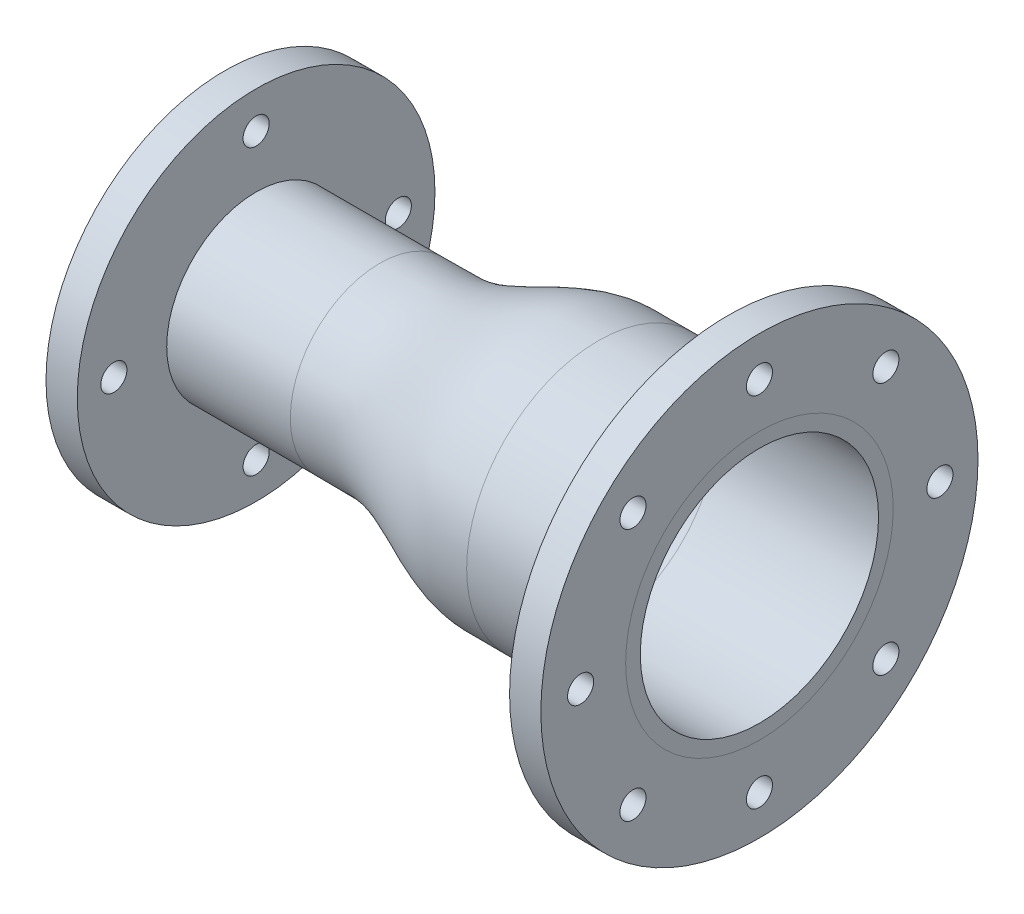
ISO-10303-21;
HEADER;
FILE_DESCRIPTION(('STEP AP214'),'2;1');
FILE_NAME('part.step','',(''),(''),'','','');
FILE_SCHEMA(('AUTOMOTIVE_DESIGN { 1 0 10303 214 1 1 1 1 }'));
ENDSEC;
DATA;
#1=APPLICATION_CONTEXT('core data for automotive mechanical design processes');
#2=APPLICATION_PROTOCOL_DEFINITION('international standard','automotive_design',2000,#1);
#3=PRODUCT_CONTEXT('',#1,'mechanical');
#4=PRODUCT('Part','Part','',(#3));
#5=PRODUCT_RELATED_PRODUCT_CATEGORY('part','',(#4));
#6=PRODUCT_DEFINITION_FORMATION('','',#4);
#7=PRODUCT_DEFINITION_CONTEXT('part definition',#1,'design');
#8=PRODUCT_DEFINITION('design','',#6,#7);
#9=PRODUCT_DEFINITION_SHAPE('','',#8);
#10=(LENGTH_UNIT() NAMED_UNIT(*) SI_UNIT(.MILLI.,.METRE.));
#11=(NAMED_UNIT(*) PLANE_ANGLE_UNIT() SI_UNIT($,.RADIAN.));
#12=(NAMED_UNIT(*) SI_UNIT($,.STERADIAN.) SOLID_ANGLE_UNIT());
#13=UNCERTAINTY_MEASURE_WITH_UNIT(LENGTH_MEASURE(1.E-05),#10,'distance_accuracy_value','');
#14=(GEOMETRIC_REPRESENTATION_CONTEXT(3) GLOBAL_UNCERTAINTY_ASSIGNED_CONTEXT((#13)) GLOBAL_UNIT_ASSIGNED_CONTEXT((#10,
#11,#12)) REPRESENTATION_CONTEXT('',''));
#15=CARTESIAN_POINT('',(0.,0.,0.));
#16=DIRECTION('',(0.,0.,1.));
#17=DIRECTION('',(1.,0.,0.));
#18=AXIS2_PLACEMENT_3D('',#15,#16,#17);
#19=CARTESIAN_POINT('',(341.700000000001,76.1374992115442,0.));
#20=DIRECTION('',(1.,0.,0.));
#21=DIRECTION('',(0.,0.,-1.));
#22=AXIS2_PLACEMENT_3D('',#19,#20,#21);
#23=PLANE('',#22);
#24=CARTESIAN_POINT('',(341.700000000001,114.3,0.));
#25=DIRECTION('',(-1.,0.,0.));
#26=DIRECTION('',(0.,0.,1.));
#27=AXIS2_PLACEMENT_3D('',#24,#25,#26);
#28=CIRCLE('',#27,8.33373999999994);
#29=CARTESIAN_POINT('',(341.700000000001,114.3,8.33373999999994));
#30=VERTEX_POINT('',#29);
#31=EDGE_CURVE('E136',#30,#30,#28,.T.);
#32=ORIENTED_EDGE('',*,*,#31,.T.);
#33=EDGE_LOOP('',(#32));
#34=FACE_BOUND('',#33,.T.);
#35=CARTESIAN_POINT('',(341.700000000001,0.,-115.366574490714));
#36=DIRECTION('',(-1.,0.,0.));
#37=DIRECTION('',(0.,0.,1.));
#38=AXIS2_PLACEMENT_3D('',#35,#36,#37);
#39=CIRCLE('',#38,8.33373999999994);
#40=CARTESIAN_POINT('',(341.700000000001,0.,-107.032834490714));
#41=VERTEX_POINT('',#40);
#42=EDGE_CURVE('E140',#41,#41,#39,.T.);
#43=ORIENTED_EDGE('',*,*,#42,.T.);
#44=EDGE_LOOP('',(#43));
#45=FACE_BOUND('',#44,.T.);
#46=CARTESIAN_POINT('',(341.700000000001,80.822305089622,-80.8223050896228));
#47=DIRECTION('',(-1.,0.,0.));
#48=DIRECTION('',(0.,0.,1.));
#49=AXIS2_PLACEMENT_3D('',#46,#47,#48);
#50=CIRCLE('',#49,8.33373999999994);
#51=CARTESIAN_POINT('',(341.700000000001,80.822305089622,-72.4885650896229));
#52=VERTEX_POINT('',#51);
#53=EDGE_CURVE('E144',#52,#52,#50,.T.);
#54=ORIENTED_EDGE('',*,*,#53,.T.);
#55=EDGE_LOOP('',(#54));
#56=FACE_BOUND('',#55,.T.);
#57=CARTESIAN_POINT('',(341.700000000001,80.8223050896225,80.8223050896222));
#58=DIRECTION('',(-1.,0.,0.));
#59=DIRECTION('',(0.,0.,1.));
#60=AXIS2_PLACEMENT_3D('',#57,#58,#59);
#61=CIRCLE('',#60,8.33373999999994);
#62=CARTESIAN_POINT('',(341.700000000001,80.8223050896225,89.1560450896222));
#63=VERTEX_POINT('',#62);
#64=EDGE_CURVE('E148',#63,#63,#61,.T.);
#65=ORIENTED_EDGE('',*,*,#64,.T.);
#66=EDGE_LOOP('',(#65));
#67=FACE_BOUND('',#66,.T.);
#68=CARTESIAN_POINT('',(341.700000000001,0.,114.3));
#69=DIRECTION('',(-1.,0.,0.));
#70=DIRECTION('',(0.,0.,1.));
#71=AXIS2_PLACEMENT_3D('',#68,#69,#70);
#72=CIRCLE('',#71,8.33373999999994);
#73=CARTESIAN_POINT('',(341.700000000001,0.,122.63374));
#74=VERTEX_POINT('',#73);
#75=EDGE_CURVE('E152',#74,#74,#72,.T.);
#76=ORIENTED_EDGE('',*,*,#75,.T.);
#77=EDGE_LOOP('',(#76));
#78=FACE_BOUND('',#77,.T.);
#79=CARTESIAN_POINT('',(341.700000000001,-80.8223050896222,80.8223050896226));
#80=DIRECTION('',(-1.,0.,0.));
#81=DIRECTION('',(0.,0.,1.));
#82=AXIS2_PLACEMENT_3D('',#79,#80,#81);
#83=CIRCLE('',#82,8.33373999999994);
#84=CARTESIAN_POINT('',(341.700000000001,-80.8223050896222,89.1560450896225));
#85=VERTEX_POINT('',#84);
#86=EDGE_CURVE('E156',#85,#85,#83,.T.);
#87=ORIENTED_EDGE('',*,*,#86,.T.);
#88=EDGE_LOOP('',(#87));
#89=FACE_BOUND('',#88,.T.);
#90=CARTESIAN_POINT('',(341.700000000001,-114.351753494402,0.));
#91=DIRECTION('',(-1.,0.,0.));
#92=DIRECTION('',(0.,0.,1.));
#93=AXIS2_PLACEMENT_3D('',#90,#91,#92);
#94=CIRCLE('',#93,8.33373999999994);
#95=CARTESIAN_POINT('',(341.700000000001,-114.351753494402,8.33373999999994));
#96=VERTEX_POINT('',#95);
#97=EDGE_CURVE('E160',#96,#96,#94,.T.);
#98=ORIENTED_EDGE('',*,*,#97,.T.);
#99=EDGE_LOOP('',(#98));
#100=FACE_BOUND('',#99,.T.);
#101=CARTESIAN_POINT('',(341.700000000001,-80.8223050896231,-80.8223050896217));
#102=DIRECTION('',(-1.,0.,0.));
#103=DIRECTION('',(0.,0.,1.));
#104=AXIS2_PLACEMENT_3D('',#101,#102,#103);
#105=CIRCLE('',#104,8.33373999999994);
#106=CARTESIAN_POINT('',(341.700000000001,-80.8223050896231,-72.4885650896217));
#107=VERTEX_POINT('',#106);
#108=EDGE_CURVE('E164',#107,#107,#105,.T.);
#109=ORIENTED_EDGE('',*,*,#108,.T.);
#110=EDGE_LOOP('',(#109));
#111=FACE_BOUND('',#110,.T.);
#112=CARTESIAN_POINT('',(341.700000000001,0.,0.));
#113=DIRECTION('',(1.,0.,0.));
#114=DIRECTION('',(0.,0.,-1.));
#115=AXIS2_PLACEMENT_3D('',#112,#113,#114);
#116=CIRCLE('',#115,139.7);
#117=CARTESIAN_POINT('',(341.700000000001,0.,-139.7));
#118=VERTEX_POINT('',#117);
#119=EDGE_CURVE('E56',#118,#118,#116,.T.);
#120=ORIENTED_EDGE('',*,*,#119,.T.);
#121=EDGE_LOOP('',(#120));
#122=FACE_BOUND('',#121,.T.);
#123=CARTESIAN_POINT('',(341.700000000001,0.,0.));
#124=DIRECTION('',(1.,0.,0.));
#125=DIRECTION('',(0.,0.,-1.));
#126=AXIS2_PLACEMENT_3D('',#123,#124,#125);
#127=CIRCLE('',#126,85.5);
#128=CARTESIAN_POINT('',(341.700000000001,0.,-85.5));
#129=VERTEX_POINT('',#128);
#130=EDGE_CURVE('E10',#129,#129,#127,.F.);
#131=ORIENTED_EDGE('',*,*,#130,.T.);
#132=EDGE_LOOP('',(#131));
#133=FACE_BOUND('',#132,.T.);
#134=ADVANCED_FACE('F37',(#34,#45,#56,#67,#78,#89,#100,#111,#122,#133),#23,.T.);
#135=CARTESIAN_POINT('',(98.9999999993154,49.1499994635115,0.));
#136=CARTESIAN_POINT('',(102.005905795316,49.1499994635115,0.));
#137=CARTESIAN_POINT('',(106.514717733581,49.1500058205691,0.));
#138=CARTESIAN_POINT('',(111.775161973298,49.1499909865593,0.));
#139=CARTESIAN_POINT('',(114.780889972295,49.1500134485051,0.));
#140=CARTESIAN_POINT('',(117.035873073658,49.1499522232787,0.));
#141=CARTESIAN_POINT('',(118.913072260754,49.1501175034362,0.));
#142=CARTESIAN_POINT('',(120.417271000994,49.1497546651663,0.));
#143=CARTESIAN_POINT('',(121.356980871118,49.1503997728442,0.));
#144=CARTESIAN_POINT('',(122.100741829042,49.1494261179276,0.));
#145=CARTESIAN_POINT('',(122.930150125829,49.1514009467106,0.));
#146=CARTESIAN_POINT('',(124.437765649482,49.1745599052383,0.));
#147=CARTESIAN_POINT('',(127.403841780676,49.3092880479699,0.));
#148=CARTESIAN_POINT('',(131.615917340567,49.7302277733076,0.));
#149=CARTESIAN_POINT('',(136.556364248026,50.5597942292282,0.));
#150=CARTESIAN_POINT('',(141.378908995782,51.6620611481624,0.));
#151=CARTESIAN_POINT('',(147.641323860487,53.4297377742553,0.));
#152=CARTESIAN_POINT('',(155.164556547672,56.0793335742276,0.));
#153=CARTESIAN_POINT('',(163.790302615286,59.6453273603352,0.));
#154=CARTESIAN_POINT('',(172.126179656528,63.3455105597902,0.));
#155=CARTESIAN_POINT('',(180.275439822738,66.9614310497359,0.));
#156=CARTESIAN_POINT('',(188.321466772932,70.2832946888392,0.));
#157=CARTESIAN_POINT('',(194.985358163584,72.6231096372374,0.));
#158=CARTESIAN_POINT('',(200.298712295905,74.1206931091162,0.));
#159=CARTESIAN_POINT('',(204.27061261078,75.0271646674049,0.));
#160=CARTESIAN_POINT('',(208.229301379162,75.6893673997792,0.));
#161=CARTESIAN_POINT('',(211.496695075637,76.0156520568596,0.));
#162=CARTESIAN_POINT('',(213.792519106971,76.1189386638725,0.));
#163=CARTESIAN_POINT('',(215.066881493287,76.1388526472972,0.));
#164=CARTESIAN_POINT('',(216.128457097101,76.1382361001372,0.));
#165=CARTESIAN_POINT('',(217.290602157146,76.1367778298357,0.));
#166=CARTESIAN_POINT('',(218.784669959143,76.1380232475798,0.));
#167=CARTESIAN_POINT('',(220.664664611946,76.1372831486288,0.));
#168=CARTESIAN_POINT('',(222.918904327775,76.1375683266448,0.));
#169=CARTESIAN_POINT('',(225.924981159851,76.1374582812377,0.));
#170=CARTESIAN_POINT('',(231.185175341817,76.1375299775448,0.));
#171=CARTESIAN_POINT('',(235.6940942797,76.1374992113344,0.));
#172=CARTESIAN_POINT('',(238.700000001038,76.1374992115442,0.));
#173=B_SPLINE_CURVE_WITH_KNOTS('',3,(#135,#136,#137,#138,#139,#140,#141,#142,#143,#144,#145,
#146,#147,#148,#149,#150,#151,#152,#153,#154,#155,#156,#157,#158,#159,#160,#161,#162,#163,#164,
#165,#166,#167,#168,#169,#170,#171,#172),.UNSPECIFIED.,.F.,.F.,(4,1,1,1,1,1,1,1,1,1,1,1,1,1,1,1,
1,1,1,1,1,1,1,1,1,1,1,1,1,1,1,1,1,1,1,4),(0.,0.0625,0.09375,0.109375,0.125,0.140625,0.1484375,
0.15625,0.16015625,0.1640625,0.171875,0.1875,0.21875,0.25,0.28125,0.3125,0.375,0.4375,0.5,
0.5625,0.625,0.6875,0.71875,0.75,0.78125,0.8125,0.828125,0.8359375,0.84375,0.8515625,0.859375,
0.875,0.890625,0.90625,0.9375,1.),.UNSPECIFIED.);
#174=CARTESIAN_POINT('',(341.700000000001,0.,0.));
#175=DIRECTION('',(1.,0.,0.));
#176=AXIS1_PLACEMENT('',#174,#175);
#177=SURFACE_OF_REVOLUTION('',#173,#176);
#178=CARTESIAN_POINT('',(238.700000001038,0.,0.));
#179=DIRECTION('',(1.,0.,0.));
#180=DIRECTION('',(0.,0.,-1.));
#181=AXIS2_PLACEMENT_3D('',#178,#179,#180);
#182=CIRCLE('',#181,76.1374992115442);
#183=CARTESIAN_POINT('',(238.700000001038,0.,-76.1374992115442));
#184=VERTEX_POINT('',#183);
#185=EDGE_CURVE('E46',#184,#184,#182,.T.);
#186=ORIENTED_EDGE('',*,*,#185,.T.);
#187=EDGE_LOOP('',(#186));
#188=FACE_BOUND('',#187,.T.);
#189=CARTESIAN_POINT('',(98.9999999993154,0.,0.));
#190=DIRECTION('',(1.,0.,0.));
#191=DIRECTION('',(0.,0.,-1.));
#192=AXIS2_PLACEMENT_3D('',#189,#190,#191);
#193=CIRCLE('',#192,49.1499994635115);
#194=CARTESIAN_POINT('',(98.9999999993154,0.,-49.1499994635115));
#195=VERTEX_POINT('',#194);
#196=EDGE_CURVE('E85',#195,#195,#193,.T.);
#197=ORIENTED_EDGE('',*,*,#196,.F.);
#198=EDGE_LOOP('',(#197));
#199=FACE_BOUND('',#198,.T.);
#200=ADVANCED_FACE('F39',(#188,#199),#177,.F.);
#201=CARTESIAN_POINT('',(341.700000000001,0.,0.));
#202=DIRECTION('',(1.,0.,0.));
#203=DIRECTION('',(0.,0.,-1.));
#204=AXIS2_PLACEMENT_3D('',#201,#202,#203);
#205=CYLINDRICAL_SURFACE('',#204,76.1374992115442);
#206=CARTESIAN_POINT('',(341.700000000001,0.,0.));
#207=DIRECTION('',(1.,0.,0.));
#208=DIRECTION('',(0.,0.,-1.));
#209=AXIS2_PLACEMENT_3D('',#206,#207,#208);
#210=CIRCLE('',#209,76.1374992115442);
#211=CARTESIAN_POINT('',(341.700000000001,0.,-76.1374992115442));
#212=VERTEX_POINT('',#211);
#213=EDGE_CURVE('E52',#212,#212,#210,.T.);
#214=ORIENTED_EDGE('',*,*,#213,.T.);
#215=EDGE_LOOP('',(#214));
#216=FACE_BOUND('',#215,.T.);
#217=ORIENTED_EDGE('',*,*,#185,.F.);
#218=EDGE_LOOP('',(#217));
#219=FACE_BOUND('',#218,.T.);
#220=ADVANCED_FACE('F121',(#216,#219),#205,.F.);
#221=ORIENTED_EDGE('',*,*,#130,.F.);
#222=EDGE_LOOP('',(#221));
#223=FACE_BOUND('',#222,.T.);
#224=ORIENTED_EDGE('',*,*,#213,.F.);
#225=EDGE_LOOP('',(#224));
#226=FACE_BOUND('',#225,.T.);
#227=ADVANCED_FACE('F118',(#223,#226),#23,.T.);
#228=CARTESIAN_POINT('',(341.700000000001,0.,0.));
#229=DIRECTION('',(1.,0.,0.));
#230=DIRECTION('',(0.,0.,-1.));
#231=AXIS2_PLACEMENT_3D('',#228,#229,#230);
#232=CYLINDRICAL_SURFACE('',#231,139.7);
#233=CARTESIAN_POINT('',(321.700000000001,0.,0.));
#234=DIRECTION('',(1.,0.,0.));
#235=DIRECTION('',(0.,0.,-1.));
#236=AXIS2_PLACEMENT_3D('',#233,#234,#235);
#237=CIRCLE('',#236,139.7);
#238=CARTESIAN_POINT('',(321.700000000001,0.,-139.7));
#239=VERTEX_POINT('',#238);
#240=EDGE_CURVE('E61',#239,#239,#237,.T.);
#241=ORIENTED_EDGE('',*,*,#240,.T.);
#242=EDGE_LOOP('',(#241));
#243=FACE_BOUND('',#242,.T.);
#244=ORIENTED_EDGE('',*,*,#119,.F.);
#245=EDGE_LOOP('',(#244));
#246=FACE_BOUND('',#245,.T.);
#247=ADVANCED_FACE('F114',(#243,#246),#232,.T.);
#248=CARTESIAN_POINT('',(321.700000000001,139.7,0.));
#249=DIRECTION('',(-1.,0.,0.));
#250=DIRECTION('',(0.,0.,1.));
#251=AXIS2_PLACEMENT_3D('',#248,#249,#250);
#252=PLANE('',#251);
#253=CARTESIAN_POINT('',(321.700000000001,114.3,0.));
#254=DIRECTION('',(-1.,0.,0.));
#255=DIRECTION('',(0.,0.,1.));
#256=AXIS2_PLACEMENT_3D('',#253,#254,#255);
#257=CIRCLE('',#256,16.1544);
#258=CARTESIAN_POINT('',(321.700000000001,114.3,16.1544));
#259=VERTEX_POINT('',#258);
#260=EDGE_CURVE('E554',#259,#259,#257,.T.);
#261=ORIENTED_EDGE('',*,*,#260,.F.);
#262=EDGE_LOOP('',(#261));
#263=FACE_BOUND('',#262,.T.);
#264=CARTESIAN_POINT('',(321.700000000001,0.,-115.366574490714));
#265=DIRECTION('',(-1.,0.,0.));
#266=DIRECTION('',(0.,0.,1.));
#267=AXIS2_PLACEMENT_3D('',#264,#265,#266);
#268=CIRCLE('',#267,16.1544);
#269=CARTESIAN_POINT('',(321.700000000001,0.,-99.2121744907141));
#270=VERTEX_POINT('',#269);
#271=EDGE_CURVE('E559',#270,#270,#268,.T.);
#272=ORIENTED_EDGE('',*,*,#271,.F.);
#273=EDGE_LOOP('',(#272));
#274=FACE_BOUND('',#273,.T.);
#275=CARTESIAN_POINT('',(321.700000000001,80.822305089622,-80.8223050896228));
#276=DIRECTION('',(-1.,0.,0.));
#277=DIRECTION('',(0.,0.,1.));
#278=AXIS2_PLACEMENT_3D('',#275,#276,#277);
#279=CIRCLE('',#278,16.1544);
#280=CARTESIAN_POINT('',(321.700000000001,80.822305089622,-64.6679050896228));
#281=VERTEX_POINT('',#280);
#282=EDGE_CURVE('E566',#281,#281,#279,.T.);
#283=ORIENTED_EDGE('',*,*,#282,.F.);
#284=EDGE_LOOP('',(#283));
#285=FACE_BOUND('',#284,.T.);
#286=CARTESIAN_POINT('',(321.700000000001,80.8223050896225,80.8223050896222));
#287=DIRECTION('',(-1.,0.,0.));
#288=DIRECTION('',(0.,0.,1.));
#289=AXIS2_PLACEMENT_3D('',#286,#287,#288);
#290=CIRCLE('',#289,16.1544);
#291=CARTESIAN_POINT('',(321.700000000001,80.8223050896225,96.9767050896222));
#292=VERTEX_POINT('',#291);
#293=EDGE_CURVE('E573',#292,#292,#290,.T.);
#294=ORIENTED_EDGE('',*,*,#293,.F.);
#295=EDGE_LOOP('',(#294));
#296=FACE_BOUND('',#295,.T.);
#297=CARTESIAN_POINT('',(321.700000000001,0.,114.3));
#298=DIRECTION('',(-1.,0.,0.));
#299=DIRECTION('',(0.,0.,1.));
#300=AXIS2_PLACEMENT_3D('',#297,#298,#299);
#301=CIRCLE('',#300,16.1544);
#302=CARTESIAN_POINT('',(321.700000000001,0.,130.4544));
#303=VERTEX_POINT('',#302);
#304=EDGE_CURVE('E580',#303,#303,#301,.T.);
#305=ORIENTED_EDGE('',*,*,#304,.F.);
#306=EDGE_LOOP('',(#305));
#307=FACE_BOUND('',#306,.T.);
#308=CARTESIAN_POINT('',(321.700000000001,-80.8223050896222,80.8223050896226));
#309=DIRECTION('',(-1.,0.,0.));
#310=DIRECTION('',(0.,0.,1.));
#311=AXIS2_PLACEMENT_3D('',#308,#309,#310);
#312=CIRCLE('',#311,16.1544);
#313=CARTESIAN_POINT('',(321.700000000001,-80.8223050896222,96.9767050896226));
#314=VERTEX_POINT('',#313);
#315=EDGE_CURVE('E587',#314,#314,#312,.T.);
#316=ORIENTED_EDGE('',*,*,#315,.F.);
#317=EDGE_LOOP('',(#316));
#318=FACE_BOUND('',#317,.T.);
#319=CARTESIAN_POINT('',(321.700000000001,-114.351753494402,0.));
#320=DIRECTION('',(-1.,0.,0.));
#321=DIRECTION('',(0.,0.,1.));
#322=AXIS2_PLACEMENT_3D('',#319,#320,#321);
#323=CIRCLE('',#322,16.1544);
#324=CARTESIAN_POINT('',(321.700000000001,-114.351753494402,16.1544));
#325=VERTEX_POINT('',#324);
#326=EDGE_CURVE('E594',#325,#325,#323,.T.);
#327=ORIENTED_EDGE('',*,*,#326,.F.);
#328=EDGE_LOOP('',(#327));
#329=FACE_BOUND('',#328,.T.);
#330=CARTESIAN_POINT('',(321.700000000001,-80.8223050896231,-80.8223050896217));
#331=DIRECTION('',(-1.,0.,0.));
#332=DIRECTION('',(0.,0.,1.));
#333=AXIS2_PLACEMENT_3D('',#330,#331,#332);
#334=CIRCLE('',#333,16.1544);
#335=CARTESIAN_POINT('',(321.700000000001,-80.8223050896231,-64.6679050896217));
#336=VERTEX_POINT('',#335);
#337=EDGE_CURVE('E175',#336,#336,#334,.T.);
#338=ORIENTED_EDGE('',*,*,#337,.F.);
#339=EDGE_LOOP('',(#338));
#340=FACE_BOUND('',#339,.T.);
#341=CARTESIAN_POINT('',(321.700000000001,0.,0.));
#342=DIRECTION('',(1.,0.,0.));
#343=DIRECTION('',(0.,0.,-1.));
#344=AXIS2_PLACEMENT_3D('',#341,#342,#343);
#345=CIRCLE('',#344,84.1374992115442);
#346=CARTESIAN_POINT('',(321.700000000001,0.,-84.1374992115442));
#347=VERTEX_POINT('',#346);
#348=EDGE_CURVE('E64',#347,#347,#345,.T.);
#349=ORIENTED_EDGE('',*,*,#348,.T.);
#350=EDGE_LOOP('',(#349));
#351=FACE_BOUND('',#350,.T.);
#352=ORIENTED_EDGE('',*,*,#240,.F.);
#353=EDGE_LOOP('',(#352));
#354=FACE_BOUND('',#353,.T.);
#355=ADVANCED_FACE('F110',(#263,#274,#285,#296,#307,#318,#329,#340,#351,#354),#252,.T.);
#356=CARTESIAN_POINT('',(341.700000000001,0.,0.));
#357=DIRECTION('',(1.,0.,0.));
#358=DIRECTION('',(0.,0.,-1.));
#359=AXIS2_PLACEMENT_3D('',#356,#357,#358);
#360=CYLINDRICAL_SURFACE('',#359,84.1374992115442);
#361=CARTESIAN_POINT('',(238.70000000048,0.,0.));
#362=DIRECTION('',(1.,0.,0.));
#363=DIRECTION('',(0.,0.,-1.));
#364=AXIS2_PLACEMENT_3D('',#361,#362,#363);
#365=CIRCLE('',#364,84.1374992115442);
#366=CARTESIAN_POINT('',(238.70000000048,0.,-84.1374992115442));
#367=VERTEX_POINT('',#366);
#368=EDGE_CURVE('E67',#367,#367,#365,.T.);
#369=ORIENTED_EDGE('',*,*,#368,.T.);
#370=EDGE_LOOP('',(#369));
#371=FACE_BOUND('',#370,.T.);
#372=ORIENTED_EDGE('',*,*,#348,.F.);
#373=EDGE_LOOP('',(#372));
#374=FACE_BOUND('',#373,.T.);
#375=ADVANCED_FACE('F105',(#371,#374),#360,.T.);
#376=CARTESIAN_POINT('',(238.70000000048,84.1374992115442,0.));
#377=CARTESIAN_POINT('',(238.355924074551,84.1374992115202,0.));
#378=CARTESIAN_POINT('',(237.667772222693,84.137499211472,0.));
#379=CARTESIAN_POINT('',(236.43892963008,84.1374992118427,0.));
#380=CARTESIAN_POINT('',(234.866011111601,84.1374992093122,0.));
#381=CARTESIAN_POINT('',(233.096477777994,84.1374992210845,0.));
#382=CARTESIAN_POINT('',(231.179483334397,84.1374991812726,0.));
#383=CARTESIAN_POINT('',(229.409949997447,84.1374993464701,0.));
#384=CARTESIAN_POINT('',(227.492955565207,84.1374987853929,0.));
#385=CARTESIAN_POINT('',(225.723422181095,84.13750111552,0.));
#386=CARTESIAN_POINT('',(223.806427909022,84.1374932020653,0.));
#387=CARTESIAN_POINT('',(222.036893859715,84.1375260673476,0.));
#388=CARTESIAN_POINT('',(220.119901846725,84.1374144528191,0.));
#389=CARTESIAN_POINT('',(218.350358415225,84.1378779989106,0.));
#390=CARTESIAN_POINT('',(216.436180481603,84.1363060251998,0.));
#391=CARTESIAN_POINT('',(214.671251810697,84.1428084951467,0.));
#392=CARTESIAN_POINT('',(212.761120780671,84.0867493050435,0.));
#393=CARTESIAN_POINT('',(210.9979704213,83.9818944784432,0.));
#394=CARTESIAN_POINT('',(209.088061418414,83.8116109676752,0.));
#395=CARTESIAN_POINT('',(207.325068084927,83.603702947119,0.));
#396=CARTESIAN_POINT('',(205.415339804882,83.3255776907741,0.));
#397=CARTESIAN_POINT('',(203.652528826209,83.0214768563703,0.));
#398=CARTESIAN_POINT('',(201.742980231223,82.6430546511927,0.));
#399=CARTESIAN_POINT('',(199.980349522116,82.2500814543988,0.));
#400=CARTESIAN_POINT('',(198.070973132176,81.7795890573477,0.));
#401=CARTESIAN_POINT('',(196.308510240827,81.3056366662936,0.));
#402=CARTESIAN_POINT('',(194.399291637108,80.7519213173461,0.));
#403=CARTESIAN_POINT('',(192.636978054456,80.2054342772218,0.));
#404=CARTESIAN_POINT('',(190.727898374793,79.5779232881772,0.));
#405=CARTESIAN_POINT('',(188.965712472328,78.9678586538311,0.));
#406=CARTESIAN_POINT('',(187.056750606921,78.2765114224032,0.));
#407=CARTESIAN_POINT('',(185.294669761322,77.6122903503984,0.));
#408=CARTESIAN_POINT('',(183.385803914716,76.8675406775993,0.));
#409=CARTESIAN_POINT('',(181.623805853851,76.158991089653,0.));
#410=CARTESIAN_POINT('',(179.715014471059,75.3716801136279,0.));
#411=CARTESIAN_POINT('',(177.95307795001,74.6289709788003,0.));
#412=CARTESIAN_POINT('',(176.044340155356,73.8102714548487,0.));
#413=CARTESIAN_POINT('',(174.282445120439,73.0438396560823,0.));
#414=CARTESIAN_POINT('',(172.373740783917,72.2051729542145,0.));
#415=CARTESIAN_POINT('',(170.611868191777,71.4256440883498,0.));
#416=CARTESIAN_POINT('',(168.70177228903,70.5779678092316,0.));
#417=CARTESIAN_POINT('',(166.937395899018,69.7949596588317,0.));
#418=CARTESIAN_POINT('',(165.024786726744,68.9494536465284,0.));
#419=CARTESIAN_POINT('',(163.259291454049,68.17439041256,0.));
#420=CARTESIAN_POINT('',(161.346657228072,67.3438616642089,0.));
#421=CARTESIAN_POINT('',(159.581128610411,66.5879813262985,0.));
#422=CARTESIAN_POINT('',(157.668449277296,65.7840030271469,0.));
#423=CARTESIAN_POINT('',(155.902867536155,65.0578995061593,0.));
#424=CARTESIAN_POINT('',(153.990122342702,64.2918325065566,0.));
#425=CARTESIAN_POINT('',(152.224466539885,63.6058636402684,0.));
#426=CARTESIAN_POINT('',(150.311633973931,62.8887699211763,0.));
#427=CARTESIAN_POINT('',(148.545882007944,62.2529807386855,0.));
#428=CARTESIAN_POINT('',(146.632940071268,61.5955435311837,0.));
#429=CARTESIAN_POINT('',(144.867069113347,61.019596499319,0.));
#430=CARTESIAN_POINT('',(142.953996030364,60.4320486383424,0.));
#431=CARTESIAN_POINT('',(141.187983586384,59.9251619950834,0.));
#432=CARTESIAN_POINT('',(139.274759097703,59.4172235456774,0.));
#433=CARTESIAN_POINT('',(137.508584812843,58.9881184916577,0.));
#434=CARTESIAN_POINT('',(135.595192140913,58.5689442371156,0.));
#435=CARTESIAN_POINT('',(133.828840435065,58.2258008751595,0.));
#436=CARTESIAN_POINT('',(131.915268777067,57.9039386315148,0.));
#437=CARTESIAN_POINT('',(130.148732425359,57.6543573124532,0.));
#438=CARTESIAN_POINT('',(128.234978669205,57.437727634692,0.));
#439=CARTESIAN_POINT('',(126.468267149077,57.2886499220858,0.));
#440=CARTESIAN_POINT('',(124.789582716265,57.1974774560598,0.));
#441=CARTESIAN_POINT('',(123.443760708449,57.1569587361165,0.));
#442=CARTESIAN_POINT('',(122.420535806049,57.1490274176523,0.));
#443=CARTESIAN_POINT('',(121.677966993461,57.1501487521835,0.));
#444=CARTESIAN_POINT('',(120.601758891239,57.1498317942184,0.));
#445=CARTESIAN_POINT('',(119.202172332257,57.1500498808639,0.));
#446=CARTESIAN_POINT('',(117.285177742255,57.149983488862,0.));
#447=CARTESIAN_POINT('',(115.515644451759,57.1500030382082,0.));
#448=CARTESIAN_POINT('',(113.598649996977,57.1499983310186,0.));
#449=CARTESIAN_POINT('',(111.829116666664,57.1499997170491,0.));
#450=CARTESIAN_POINT('',(109.912122221469,57.1499993832964,0.));
#451=CARTESIAN_POINT('',(108.142588888334,57.1499994815527,0.));
#452=CARTESIAN_POINT('',(106.225594443819,57.1499994578749,0.));
#453=CARTESIAN_POINT('',(104.456061110483,57.1499994648313,0.));
#454=CARTESIAN_POINT('',(102.539066666016,57.1499994631282,0.));
#455=CARTESIAN_POINT('',(101.039878703039,57.1499994635708,0.));
#456=CARTESIAN_POINT('',(99.8110361104344,57.1499994635114,0.));
#457=CARTESIAN_POINT('',(99.2703453696884,57.1499994635115,0.));
#458=CARTESIAN_POINT('',(98.9999999993154,57.1499994635115,0.));
#459=(BOUNDED_CURVE() B_SPLINE_CURVE(3,(#376,#377,#378,#379,#380,#381,#382,#383,#384,#385,#386,
#387,#388,#389,#390,#391,#392,#393,#394,#395,#396,#397,#398,#399,#400,#401,#402,#403,#404,#405,
#406,#407,#408,#409,#410,#411,#412,#413,#414,#415,#416,#417,#418,#419,#420,#421,#422,#423,#424,
#425,#426,#427,#428,#429,#430,#431,#432,#433,#434,#435,#436,#437,#438,#439,#440,#441,#442,#443,
#444,#445,#446,#447,#448,#449,#450,#451,#452,#453,#454,#455,#456,#457,#458),.UNSPECIFIED.,.F.,
.F.) B_SPLINE_CURVE_WITH_KNOTS((4,1,1,1,1,1,1,1,1,1,1,1,1,1,1,1,1,1,1,1,1,1,1,1,1,1,1,1,1,1,1,1,
1,1,1,1,1,1,1,1,1,1,1,1,1,1,1,1,1,1,1,1,1,1,1,1,1,1,1,1,1,1,1,1,1,1,1,1,1,1,1,1,1,1,1,1,1,1,1,1,
4),(0.,0.00715416466130086,0.0143083293226017,0.0255505880760745,0.0398589173986762,
0.051101176152149,0.0654095054747508,0.0766517642282235,0.0909600935508253,0.102202352304298,
0.1165106816269,0.127752940380373,0.142061269702974,0.153303528456447,0.167554007786719,
0.178755429228364,0.193030914898765,0.204271904910274,0.218620641734998,0.229935227483346,
0.244395419546109,0.255809504611402,0.270408809056224,0.281939941450494,0.29669540911253,
0.308352906833696,0.323271342218976,0.335056717549753,0.350135378469548,0.362042997576286,
0.3772705556946,0.389288475006168,0.40464616843142,0.416757098654122,0.432220020972812,
0.444402380472081,0.45994086361034,0.472169892049146,0.487750951123586,0.499999861803356,
0.515620649586765,0.527886880088368,0.543480106626163,0.555711059560346,0.571242544952542,
0.583412273814947,0.598850533365244,0.610935794468536,0.626253517756318,0.638234914593141,
0.653410393103734,0.665273470015964,0.680291944874892,0.692028203974552,0.706883095638552,
0.718490902382347,0.733184871620732,0.744670204017162,0.759215980069462,0.770592965802685,
0.785013865191362,0.796305043597434,0.810635097760218,0.821871343483024,0.831256631837378,
0.838627864782687,0.843146284568772,0.846696471543553,0.861004800866154,0.872247059619627,
0.886555388942229,0.897797647695702,0.912105977018304,0.923348235771776,0.937656565094378,
0.948898823847851,0.963207153170453,0.974449411923925,0.988757741246527,0.994378870623264,1.),
.UNSPECIFIED.) CURVE() GEOMETRIC_REPRESENTATION_ITEM() RATIONAL_B_SPLINE_CURVE((0.576132147620015,
0.576132147620015,0.576132147620016,0.576132147620015,0.576132147620016,0.576132147620015,
0.576132147620015,0.576132147620015,0.576132147620015,0.576132147620016,0.576132147620015,
0.576132147620016,0.576132147620015,0.576132147620015,0.576132147620015,0.576132147620015,
0.576132147620016,0.576132147620015,0.576132147620016,0.576132147620016,0.576132147620015,
0.576132147620016,0.576132147620015,0.576132147620016,0.576132147620015,0.576132147620015,
0.576132147620015,0.576132147620015,0.576132147620015,0.576132147620015,0.576132147620016,
0.576132147620015,0.576132147620016,0.576132147620015,0.576132147620016,0.576132147620016,
0.576132147620015,0.576132147620015,0.576132147620015,0.576132147620016,0.576132147620015,
0.576132147620015,0.576132147620016,0.576132147620015,0.576132147620016,0.576132147620015,
0.576132147620015,0.576132147620015,0.576132147620016,0.576132147620015,0.576132147620015,
0.576132147620015,0.576132147620015,0.576132147620016,0.576132147620015,0.576132147620015,
0.576132147620015,0.576132147620015,0.576132147620015,0.576132147620016,0.576132147620015,
0.576132147620016,0.576132147620015,0.576132147620015,0.576132147620015,0.576132147620015,
0.576132147620015,0.576132147620015,0.576132147620015,0.576132147620016,0.576132147620015,
0.576132147620016,0.576132147620015,0.576132147620016,0.576132147620016,0.576132147620016,
0.576132147620015,0.576132147620016,0.576132147620015,0.576132147620016,0.576132147620015,
0.576132147620015,0.576132147620015)) REPRESENTATION_ITEM(''));
#460=CARTESIAN_POINT('',(341.700000000001,0.,0.));
#461=DIRECTION('',(1.,0.,0.));
#462=AXIS1_PLACEMENT('',#460,#461);
#463=SURFACE_OF_REVOLUTION('',#459,#462);
#464=CARTESIAN_POINT('',(98.9999999993154,0.,0.));
#465=DIRECTION('',(1.,0.,0.));
#466=DIRECTION('',(0.,0.,-1.));
#467=AXIS2_PLACEMENT_3D('',#464,#465,#466);
#468=CIRCLE('',#467,57.1499994635115);
#469=CARTESIAN_POINT('',(98.9999999993154,0.,-57.1499994635115));
#470=VERTEX_POINT('',#469);
#471=EDGE_CURVE('E70',#470,#470,#468,.T.);
#472=ORIENTED_EDGE('',*,*,#471,.T.);
#473=EDGE_LOOP('',(#472));
#474=FACE_BOUND('',#473,.T.);
#475=ORIENTED_EDGE('',*,*,#368,.F.);
#476=EDGE_LOOP('',(#475));
#477=FACE_BOUND('',#476,.T.);
#478=ADVANCED_FACE('F100',(#474,#477),#463,.F.);
#479=CARTESIAN_POINT('',(341.700000000001,0.,0.));
#480=DIRECTION('',(1.,0.,0.));
#481=DIRECTION('',(0.,0.,-1.));
#482=AXIS2_PLACEMENT_3D('',#479,#480,#481);
#483=CYLINDRICAL_SURFACE('',#482,57.1499994635115);
#484=CARTESIAN_POINT('',(20.,0.,0.));
#485=DIRECTION('',(1.,0.,0.));
#486=DIRECTION('',(0.,0.,-1.));
#487=AXIS2_PLACEMENT_3D('',#484,#485,#486);
#488=CIRCLE('',#487,57.1499994635115);
#489=CARTESIAN_POINT('',(20.,0.,-57.1499994635115));
#490=VERTEX_POINT('',#489);
#491=EDGE_CURVE('E73',#490,#490,#488,.T.);
#492=ORIENTED_EDGE('',*,*,#491,.T.);
#493=EDGE_LOOP('',(#492));
#494=FACE_BOUND('',#493,.T.);
#495=ORIENTED_EDGE('',*,*,#471,.F.);
#496=EDGE_LOOP('',(#495));
#497=FACE_BOUND('',#496,.T.);
#498=ADVANCED_FACE('F104',(#494,#497),#483,.T.);
#499=CARTESIAN_POINT('',(20.,114.3,0.));
#500=DIRECTION('',(1.,0.,0.));
#501=DIRECTION('',(0.,0.,-1.));
#502=AXIS2_PLACEMENT_3D('',#499,#500,#501);
#503=PLANE('',#502);
#504=CARTESIAN_POINT('',(20.,90.8527596999048,0.));
#505=DIRECTION('',(1.,0.,0.));
#506=DIRECTION('',(0.,0.,-1.));
#507=AXIS2_PLACEMENT_3D('',#504,#505,#506);
#508=CIRCLE('',#507,8.33373999999994);
#509=CARTESIAN_POINT('',(20.,90.8527596999048,-8.33373999999994));
#510=VERTEX_POINT('',#509);
#511=EDGE_CURVE('E172',#510,#510,#508,.F.);
#512=ORIENTED_EDGE('',*,*,#511,.T.);
#513=EDGE_LOOP('',(#512));
#514=FACE_BOUND('',#513,.T.);
#515=CARTESIAN_POINT('',(20.,0.,90.9113801471292));
#516=DIRECTION('',(1.,0.,0.));
#517=DIRECTION('',(0.,0.,-1.));
#518=AXIS2_PLACEMENT_3D('',#515,#516,#517);
#519=CIRCLE('',#518,8.33373999999995);
#520=CARTESIAN_POINT('',(20.,0.,82.5776401471292));
#521=VERTEX_POINT('',#520);
#522=EDGE_CURVE('E184',#521,#521,#519,.F.);
#523=ORIENTED_EDGE('',*,*,#522,.T.);
#524=EDGE_LOOP('',(#523));
#525=FACE_BOUND('',#524,.T.);
#526=CARTESIAN_POINT('',(20.,-90.9113801471292,0.));
#527=DIRECTION('',(1.,0.,0.));
#528=DIRECTION('',(0.,0.,-1.));
#529=AXIS2_PLACEMENT_3D('',#526,#527,#528);
#530=CIRCLE('',#529,8.33373999999994);
#531=CARTESIAN_POINT('',(20.,-90.9113801471292,-8.33373999999994));
#532=VERTEX_POINT('',#531);
#533=EDGE_CURVE('E190',#532,#532,#530,.F.);
#534=ORIENTED_EDGE('',*,*,#533,.T.);
#535=EDGE_LOOP('',(#534));
#536=FACE_BOUND('',#535,.T.);
#537=CARTESIAN_POINT('',(20.,0.,-90.9113801471292));
#538=DIRECTION('',(1.,0.,0.));
#539=DIRECTION('',(0.,0.,-1.));
#540=AXIS2_PLACEMENT_3D('',#537,#538,#539);
#541=CIRCLE('',#540,8.33373999999995);
#542=CARTESIAN_POINT('',(20.,0.,-99.2451201471291));
#543=VERTEX_POINT('',#542);
#544=EDGE_CURVE('E88',#543,#543,#541,.F.);
#545=ORIENTED_EDGE('',*,*,#544,.T.);
#546=EDGE_LOOP('',(#545));
#547=FACE_BOUND('',#546,.T.);
#548=CARTESIAN_POINT('',(20.,0.,0.));
#549=DIRECTION('',(1.,0.,0.));
#550=DIRECTION('',(0.,0.,-1.));
#551=AXIS2_PLACEMENT_3D('',#548,#549,#550);
#552=CIRCLE('',#551,114.3);
#553=CARTESIAN_POINT('',(20.,0.,-114.3));
#554=VERTEX_POINT('',#553);
#555=EDGE_CURVE('E76',#554,#554,#552,.T.);
#556=ORIENTED_EDGE('',*,*,#555,.T.);
#557=EDGE_LOOP('',(#556));
#558=FACE_BOUND('',#557,.T.);
#559=ORIENTED_EDGE('',*,*,#491,.F.);
#560=EDGE_LOOP('',(#559));
#561=FACE_BOUND('',#560,.T.);
#562=ADVANCED_FACE('F198',(#514,#525,#536,#547,#558,#561),#503,.T.);
#563=CARTESIAN_POINT('',(341.700000000001,0.,0.));
#564=DIRECTION('',(1.,0.,0.));
#565=DIRECTION('',(0.,0.,-1.));
#566=AXIS2_PLACEMENT_3D('',#563,#564,#565);
#567=CYLINDRICAL_SURFACE('',#566,114.3);
#568=CARTESIAN_POINT('',(0.,0.,0.));
#569=DIRECTION('',(1.,0.,0.));
#570=DIRECTION('',(0.,0.,-1.));
#571=AXIS2_PLACEMENT_3D('',#568,#569,#570);
#572=CIRCLE('',#571,114.3);
#573=CARTESIAN_POINT('',(0.,0.,-114.3));
#574=VERTEX_POINT('',#573);
#575=EDGE_CURVE('E79',#574,#574,#572,.T.);
#576=ORIENTED_EDGE('',*,*,#575,.T.);
#577=EDGE_LOOP('',(#576));
#578=FACE_BOUND('',#577,.T.);
#579=ORIENTED_EDGE('',*,*,#555,.F.);
#580=EDGE_LOOP('',(#579));
#581=FACE_BOUND('',#580,.T.);
#582=ADVANCED_FACE('F212',(#578,#581),#567,.T.);
#583=CARTESIAN_POINT('',(0.,114.3,0.));
#584=DIRECTION('',(-1.,0.,0.));
#585=DIRECTION('',(0.,0.,1.));
#586=AXIS2_PLACEMENT_3D('',#583,#584,#585);
#587=PLANE('',#586);
#588=CARTESIAN_POINT('',(0.,90.8527596999048,0.));
#589=DIRECTION('',(-1.,0.,0.));
#590=DIRECTION('',(0.,0.,1.));
#591=AXIS2_PLACEMENT_3D('',#588,#589,#590);
#592=CIRCLE('',#591,8.3337399999999);
#593=CARTESIAN_POINT('',(0.,90.8527596999048,8.3337399999999));
#594=VERTEX_POINT('',#593);
#595=EDGE_CURVE('E168',#594,#594,#592,.T.);
#596=ORIENTED_EDGE('',*,*,#595,.F.);
#597=EDGE_LOOP('',(#596));
#598=FACE_BOUND('',#597,.T.);
#599=CARTESIAN_POINT('',(0.,0.,90.9113801471292));
#600=DIRECTION('',(-1.,0.,0.));
#601=DIRECTION('',(0.,0.,1.));
#602=AXIS2_PLACEMENT_3D('',#599,#600,#601);
#603=CIRCLE('',#602,8.3337399999999);
#604=CARTESIAN_POINT('',(0.,0.,99.2451201471291));
#605=VERTEX_POINT('',#604);
#606=EDGE_CURVE('E181',#605,#605,#603,.T.);
#607=ORIENTED_EDGE('',*,*,#606,.F.);
#608=EDGE_LOOP('',(#607));
#609=FACE_BOUND('',#608,.T.);
#610=CARTESIAN_POINT('',(0.,-90.9113801471292,0.));
#611=DIRECTION('',(-1.,0.,0.));
#612=DIRECTION('',(0.,0.,1.));
#613=AXIS2_PLACEMENT_3D('',#610,#611,#612);
#614=CIRCLE('',#613,8.3337399999999);
#615=CARTESIAN_POINT('',(0.,-90.9113801471292,8.3337399999999));
#616=VERTEX_POINT('',#615);
#617=EDGE_CURVE('E187',#616,#616,#614,.T.);
#618=ORIENTED_EDGE('',*,*,#617,.F.);
#619=EDGE_LOOP('',(#618));
#620=FACE_BOUND('',#619,.T.);
#621=CARTESIAN_POINT('',(0.,0.,-90.9113801471292));
#622=DIRECTION('',(-1.,0.,0.));
#623=DIRECTION('',(0.,0.,1.));
#624=AXIS2_PLACEMENT_3D('',#621,#622,#623);
#625=CIRCLE('',#624,8.3337399999999);
#626=CARTESIAN_POINT('',(0.,0.,-82.5776401471293));
#627=VERTEX_POINT('',#626);
#628=EDGE_CURVE('E193',#627,#627,#625,.T.);
#629=ORIENTED_EDGE('',*,*,#628,.F.);
#630=EDGE_LOOP('',(#629));
#631=FACE_BOUND('',#630,.T.);
#632=CARTESIAN_POINT('',(0.,0.,0.));
#633=DIRECTION('',(1.,0.,0.));
#634=DIRECTION('',(0.,0.,-1.));
#635=AXIS2_PLACEMENT_3D('',#632,#633,#634);
#636=CIRCLE('',#635,49.1499994635115);
#637=CARTESIAN_POINT('',(0.,0.,-49.1499994635115));
#638=VERTEX_POINT('',#637);
#639=EDGE_CURVE('E82',#638,#638,#636,.T.);
#640=ORIENTED_EDGE('',*,*,#639,.T.);
#641=EDGE_LOOP('',(#640));
#642=FACE_BOUND('',#641,.T.);
#643=ORIENTED_EDGE('',*,*,#575,.F.);
#644=EDGE_LOOP('',(#643));
#645=FACE_BOUND('',#644,.T.);
#646=ADVANCED_FACE('F209',(#598,#609,#620,#631,#642,#645),#587,.T.);
#647=CARTESIAN_POINT('',(341.700000000001,0.,0.));
#648=DIRECTION('',(1.,0.,0.));
#649=DIRECTION('',(0.,0.,-1.));
#650=AXIS2_PLACEMENT_3D('',#647,#648,#649);
#651=CYLINDRICAL_SURFACE('',#650,49.1499994635115);
#652=ORIENTED_EDGE('',*,*,#196,.T.);
#653=EDGE_LOOP('',(#652));
#654=FACE_BOUND('',#653,.T.);
#655=ORIENTED_EDGE('',*,*,#639,.F.);
#656=EDGE_LOOP('',(#655));
#657=FACE_BOUND('',#656,.T.);
#658=ADVANCED_FACE('F205',(#654,#657),#651,.F.);
#659=CARTESIAN_POINT('',(0.,0.,-90.9113801471292));
#660=DIRECTION('',(-1.,0.,0.));
#661=DIRECTION('',(0.,0.,1.));
#662=AXIS2_PLACEMENT_3D('',#659,#660,#661);
#663=CYLINDRICAL_SURFACE('',#662,8.33373999999995);
#664=ORIENTED_EDGE('',*,*,#544,.F.);
#665=EDGE_LOOP('',(#664));
#666=FACE_BOUND('',#665,.T.);
#667=ORIENTED_EDGE('',*,*,#628,.T.);
#668=EDGE_LOOP('',(#667));
#669=FACE_BOUND('',#668,.T.);
#670=ADVANCED_FACE('F201',(#666,#669),#663,.F.);
#671=CARTESIAN_POINT('',(0.,-90.9113801471292,0.));
#672=DIRECTION('',(-1.,0.,0.));
#673=DIRECTION('',(0.,0.,1.));
#674=AXIS2_PLACEMENT_3D('',#671,#672,#673);
#675=CYLINDRICAL_SURFACE('',#674,8.33373999999994);
#676=ORIENTED_EDGE('',*,*,#533,.F.);
#677=EDGE_LOOP('',(#676));
#678=FACE_BOUND('',#677,.T.);
#679=ORIENTED_EDGE('',*,*,#617,.T.);
#680=EDGE_LOOP('',(#679));
#681=FACE_BOUND('',#680,.T.);
#682=ADVANCED_FACE('F204',(#678,#681),#675,.F.);
#683=CARTESIAN_POINT('',(0.,0.,90.9113801471292));
#684=DIRECTION('',(-1.,0.,0.));
#685=DIRECTION('',(0.,0.,1.));
#686=AXIS2_PLACEMENT_3D('',#683,#684,#685);
#687=CYLINDRICAL_SURFACE('',#686,8.33373999999995);
#688=ORIENTED_EDGE('',*,*,#522,.F.);
#689=EDGE_LOOP('',(#688));
#690=FACE_BOUND('',#689,.T.);
#691=ORIENTED_EDGE('',*,*,#606,.T.);
#692=EDGE_LOOP('',(#691));
#693=FACE_BOUND('',#692,.T.);
#694=ADVANCED_FACE('F265',(#690,#693),#687,.F.);
#695=CARTESIAN_POINT('',(0.,90.8527596999048,0.));
#696=DIRECTION('',(-1.,0.,0.));
#697=DIRECTION('',(0.,0.,1.));
#698=AXIS2_PLACEMENT_3D('',#695,#696,#697);
#699=CYLINDRICAL_SURFACE('',#698,8.33373999999994);
#700=ORIENTED_EDGE('',*,*,#511,.F.);
#701=EDGE_LOOP('',(#700));
#702=FACE_BOUND('',#701,.T.);
#703=ORIENTED_EDGE('',*,*,#595,.T.);
#704=EDGE_LOOP('',(#703));
#705=FACE_BOUND('',#704,.T.);
#706=ADVANCED_FACE('F272',(#702,#705),#699,.F.);
#707=CARTESIAN_POINT('',(321.700000000001,-80.8223050896231,-80.8223050896217));
#708=DIRECTION('',(-1.,0.,0.));
#709=DIRECTION('',(0.,0.,1.));
#710=AXIS2_PLACEMENT_3D('',#707,#708,#709);
#711=CYLINDRICAL_SURFACE('',#710,8.33373999999997);
#712=ORIENTED_EDGE('',*,*,#108,.F.);
#713=EDGE_LOOP('',(#712));
#714=FACE_BOUND('',#713,.T.);
#715=CARTESIAN_POINT('',(328.262312921564,-80.8223050896231,-80.8223050896217));
#716=DIRECTION('',(-1.,0.,0.));
#717=DIRECTION('',(0.,0.,1.));
#718=AXIS2_PLACEMENT_3D('',#715,#716,#717);
#719=CIRCLE('',#718,8.33373999999999);
#720=CARTESIAN_POINT('',(328.262312921564,-80.8223050896231,-72.4885650896217));
#721=VERTEX_POINT('',#720);
#722=EDGE_CURVE('E169',#721,#721,#719,.T.);
#723=ORIENTED_EDGE('',*,*,#722,.T.);
#724=EDGE_LOOP('',(#723));
#725=FACE_BOUND('',#724,.T.);
#726=ADVANCED_FACE('F279',(#714,#725),#711,.F.);
#727=CARTESIAN_POINT('',(321.700000000001,-80.8223050896231,-80.8223050896217));
#728=DIRECTION('',(-1.,0.,0.));
#729=DIRECTION('',(0.,0.,1.));
#730=AXIS2_PLACEMENT_3D('',#727,#728,#729);
#731=CONICAL_SURFACE('',#730,16.1544,0.872664625997166);
#732=ORIENTED_EDGE('',*,*,#722,.F.);
#733=EDGE_LOOP('',(#732));
#734=FACE_BOUND('',#733,.T.);
#735=ORIENTED_EDGE('',*,*,#337,.T.);
#736=EDGE_LOOP('',(#735));
#737=FACE_BOUND('',#736,.T.);
#738=ADVANCED_FACE('F286',(#734,#737),#731,.F.);
#739=CARTESIAN_POINT('',(321.700000000001,-114.351753494402,0.));
#740=DIRECTION('',(-1.,0.,0.));
#741=DIRECTION('',(0.,0.,1.));
#742=AXIS2_PLACEMENT_3D('',#739,#740,#741);
#743=CYLINDRICAL_SURFACE('',#742,8.33373999999997);
#744=ORIENTED_EDGE('',*,*,#97,.F.);
#745=EDGE_LOOP('',(#744));
#746=FACE_BOUND('',#745,.T.);
#747=CARTESIAN_POINT('',(328.262312921564,-114.351753494402,0.));
#748=DIRECTION('',(-1.,0.,0.));
#749=DIRECTION('',(0.,0.,1.));
#750=AXIS2_PLACEMENT_3D('',#747,#748,#749);
#751=CIRCLE('',#750,8.33373999999999);
#752=CARTESIAN_POINT('',(328.262312921564,-114.351753494402,8.33373999999999));
#753=VERTEX_POINT('',#752);
#754=EDGE_CURVE('E597',#753,#753,#751,.T.);
#755=ORIENTED_EDGE('',*,*,#754,.T.);
#756=EDGE_LOOP('',(#755));
#757=FACE_BOUND('',#756,.T.);
#758=ADVANCED_FACE('F292',(#746,#757),#743,.F.);
#759=CARTESIAN_POINT('',(321.700000000001,-114.351753494402,0.));
#760=DIRECTION('',(-1.,0.,0.));
#761=DIRECTION('',(0.,0.,1.));
#762=AXIS2_PLACEMENT_3D('',#759,#760,#761);
#763=CONICAL_SURFACE('',#762,16.1544,0.872664625997166);
#764=ORIENTED_EDGE('',*,*,#754,.F.);
#765=EDGE_LOOP('',(#764));
#766=FACE_BOUND('',#765,.T.);
#767=ORIENTED_EDGE('',*,*,#326,.T.);
#768=EDGE_LOOP('',(#767));
#769=FACE_BOUND('',#768,.T.);
#770=ADVANCED_FACE('F299',(#766,#769),#763,.F.);
#771=CARTESIAN_POINT('',(321.700000000001,-80.8223050896222,80.8223050896226));
#772=DIRECTION('',(-1.,0.,0.));
#773=DIRECTION('',(0.,0.,1.));
#774=AXIS2_PLACEMENT_3D('',#771,#772,#773);
#775=CYLINDRICAL_SURFACE('',#774,8.33373999999997);
#776=ORIENTED_EDGE('',*,*,#86,.F.);
#777=EDGE_LOOP('',(#776));
#778=FACE_BOUND('',#777,.T.);
#779=CARTESIAN_POINT('',(328.262312921564,-80.8223050896222,80.8223050896226));
#780=DIRECTION('',(-1.,0.,0.));
#781=DIRECTION('',(0.,0.,1.));
#782=AXIS2_PLACEMENT_3D('',#779,#780,#781);
#783=CIRCLE('',#782,8.33373999999999);
#784=CARTESIAN_POINT('',(328.262312921564,-80.8223050896222,89.1560450896226));
#785=VERTEX_POINT('',#784);
#786=EDGE_CURVE('E590',#785,#785,#783,.T.);
#787=ORIENTED_EDGE('',*,*,#786,.T.);
#788=EDGE_LOOP('',(#787));
#789=FACE_BOUND('',#788,.T.);
#790=ADVANCED_FACE('F306',(#778,#789),#775,.F.);
#791=CARTESIAN_POINT('',(321.700000000001,-80.8223050896222,80.8223050896226));
#792=DIRECTION('',(-1.,0.,0.));
#793=DIRECTION('',(0.,0.,1.));
#794=AXIS2_PLACEMENT_3D('',#791,#792,#793);
#795=CONICAL_SURFACE('',#794,16.1544,0.872664625997166);
#796=ORIENTED_EDGE('',*,*,#786,.F.);
#797=EDGE_LOOP('',(#796));
#798=FACE_BOUND('',#797,.T.);
#799=ORIENTED_EDGE('',*,*,#315,.T.);
#800=EDGE_LOOP('',(#799));
#801=FACE_BOUND('',#800,.T.);
#802=ADVANCED_FACE('F313',(#798,#801),#795,.F.);
#803=CARTESIAN_POINT('',(321.700000000001,0.,114.3));
#804=DIRECTION('',(-1.,0.,0.));
#805=DIRECTION('',(0.,0.,1.));
#806=AXIS2_PLACEMENT_3D('',#803,#804,#805);
#807=CYLINDRICAL_SURFACE('',#806,8.33373999999996);
#808=ORIENTED_EDGE('',*,*,#75,.F.);
#809=EDGE_LOOP('',(#808));
#810=FACE_BOUND('',#809,.T.);
#811=CARTESIAN_POINT('',(328.262312921564,0.,114.3));
#812=DIRECTION('',(-1.,0.,0.));
#813=DIRECTION('',(0.,0.,1.));
#814=AXIS2_PLACEMENT_3D('',#811,#812,#813);
#815=CIRCLE('',#814,8.33373999999999);
#816=CARTESIAN_POINT('',(328.262312921564,0.,122.63374));
#817=VERTEX_POINT('',#816);
#818=EDGE_CURVE('E583',#817,#817,#815,.T.);
#819=ORIENTED_EDGE('',*,*,#818,.T.);
#820=EDGE_LOOP('',(#819));
#821=FACE_BOUND('',#820,.T.);
#822=ADVANCED_FACE('F320',(#810,#821),#807,.F.);
#823=CARTESIAN_POINT('',(321.700000000001,0.,114.3));
#824=DIRECTION('',(-1.,0.,0.));
#825=DIRECTION('',(0.,0.,1.));
#826=AXIS2_PLACEMENT_3D('',#823,#824,#825);
#827=CONICAL_SURFACE('',#826,16.1544,0.872664625997166);
#828=ORIENTED_EDGE('',*,*,#818,.F.);
#829=EDGE_LOOP('',(#828));
#830=FACE_BOUND('',#829,.T.);
#831=ORIENTED_EDGE('',*,*,#304,.T.);
#832=EDGE_LOOP('',(#831));
#833=FACE_BOUND('',#832,.T.);
#834=ADVANCED_FACE('F327',(#830,#833),#827,.F.);
#835=CARTESIAN_POINT('',(321.700000000001,80.8223050896225,80.8223050896222));
#836=DIRECTION('',(-1.,0.,0.));
#837=DIRECTION('',(0.,0.,1.));
#838=AXIS2_PLACEMENT_3D('',#835,#836,#837);
#839=CYLINDRICAL_SURFACE('',#838,8.33373999999997);
#840=ORIENTED_EDGE('',*,*,#64,.F.);
#841=EDGE_LOOP('',(#840));
#842=FACE_BOUND('',#841,.T.);
#843=CARTESIAN_POINT('',(328.262312921564,80.8223050896225,80.8223050896222));
#844=DIRECTION('',(-1.,0.,0.));
#845=DIRECTION('',(0.,0.,1.));
#846=AXIS2_PLACEMENT_3D('',#843,#844,#845);
#847=CIRCLE('',#846,8.33373999999999);
#848=CARTESIAN_POINT('',(328.262312921564,80.8223050896225,89.1560450896222));
#849=VERTEX_POINT('',#848);
#850=EDGE_CURVE('E576',#849,#849,#847,.T.);
#851=ORIENTED_EDGE('',*,*,#850,.T.);
#852=EDGE_LOOP('',(#851));
#853=FACE_BOUND('',#852,.T.);
#854=ADVANCED_FACE('F334',(#842,#853),#839,.F.);
#855=CARTESIAN_POINT('',(321.700000000001,80.8223050896225,80.8223050896222));
#856=DIRECTION('',(-1.,0.,0.));
#857=DIRECTION('',(0.,0.,1.));
#858=AXIS2_PLACEMENT_3D('',#855,#856,#857);
#859=CONICAL_SURFACE('',#858,16.1544,0.872664625997166);
#860=ORIENTED_EDGE('',*,*,#850,.F.);
#861=EDGE_LOOP('',(#860));
#862=FACE_BOUND('',#861,.T.);
#863=ORIENTED_EDGE('',*,*,#293,.T.);
#864=EDGE_LOOP('',(#863));
#865=FACE_BOUND('',#864,.T.);
#866=ADVANCED_FACE('F341',(#862,#865),#859,.F.);
#867=CARTESIAN_POINT('',(321.700000000001,80.822305089622,-80.8223050896228));
#868=DIRECTION('',(-1.,0.,0.));
#869=DIRECTION('',(0.,0.,1.));
#870=AXIS2_PLACEMENT_3D('',#867,#868,#869);
#871=CYLINDRICAL_SURFACE('',#870,8.33373999999997);
#872=ORIENTED_EDGE('',*,*,#53,.F.);
#873=EDGE_LOOP('',(#872));
#874=FACE_BOUND('',#873,.T.);
#875=CARTESIAN_POINT('',(328.262312921564,80.822305089622,-80.8223050896228));
#876=DIRECTION('',(-1.,0.,0.));
#877=DIRECTION('',(0.,0.,1.));
#878=AXIS2_PLACEMENT_3D('',#875,#876,#877);
#879=CIRCLE('',#878,8.33373999999999);
#880=CARTESIAN_POINT('',(328.262312921564,80.822305089622,-72.4885650896228));
#881=VERTEX_POINT('',#880);
#882=EDGE_CURVE('E569',#881,#881,#879,.T.);
#883=ORIENTED_EDGE('',*,*,#882,.T.);
#884=EDGE_LOOP('',(#883));
#885=FACE_BOUND('',#884,.T.);
#886=ADVANCED_FACE('F348',(#874,#885),#871,.F.);
#887=CARTESIAN_POINT('',(321.700000000001,80.822305089622,-80.8223050896228));
#888=DIRECTION('',(-1.,0.,0.));
#889=DIRECTION('',(0.,0.,1.));
#890=AXIS2_PLACEMENT_3D('',#887,#888,#889);
#891=CONICAL_SURFACE('',#890,16.1544,0.872664625997166);
#892=ORIENTED_EDGE('',*,*,#882,.F.);
#893=EDGE_LOOP('',(#892));
#894=FACE_BOUND('',#893,.T.);
#895=ORIENTED_EDGE('',*,*,#282,.T.);
#896=EDGE_LOOP('',(#895));
#897=FACE_BOUND('',#896,.T.);
#898=ADVANCED_FACE('F355',(#894,#897),#891,.F.);
#899=CARTESIAN_POINT('',(321.700000000001,0.,-115.366574490714));
#900=DIRECTION('',(-1.,0.,0.));
#901=DIRECTION('',(0.,0.,1.));
#902=AXIS2_PLACEMENT_3D('',#899,#900,#901);
#903=CYLINDRICAL_SURFACE('',#902,8.33373999999996);
#904=ORIENTED_EDGE('',*,*,#42,.F.);
#905=EDGE_LOOP('',(#904));
#906=FACE_BOUND('',#905,.T.);
#907=CARTESIAN_POINT('',(328.262312921564,0.,-115.366574490714));
#908=DIRECTION('',(-1.,0.,0.));
#909=DIRECTION('',(0.,0.,1.));
#910=AXIS2_PLACEMENT_3D('',#907,#908,#909);
#911=CIRCLE('',#910,8.33373999999999);
#912=CARTESIAN_POINT('',(328.262312921564,0.,-107.032834490714));
#913=VERTEX_POINT('',#912);
#914=EDGE_CURVE('E562',#913,#913,#911,.T.);
#915=ORIENTED_EDGE('',*,*,#914,.T.);
#916=EDGE_LOOP('',(#915));
#917=FACE_BOUND('',#916,.T.);
#918=ADVANCED_FACE('F362',(#906,#917),#903,.F.);
#919=CARTESIAN_POINT('',(321.700000000001,0.,-115.366574490714));
#920=DIRECTION('',(-1.,0.,0.));
#921=DIRECTION('',(0.,0.,1.));
#922=AXIS2_PLACEMENT_3D('',#919,#920,#921);
#923=CONICAL_SURFACE('',#922,16.1544,0.872664625997166);
#924=ORIENTED_EDGE('',*,*,#914,.F.);
#925=EDGE_LOOP('',(#924));
#926=FACE_BOUND('',#925,.T.);
#927=ORIENTED_EDGE('',*,*,#271,.T.);
#928=EDGE_LOOP('',(#927));
#929=FACE_BOUND('',#928,.T.);
#930=ADVANCED_FACE('F369',(#926,#929),#923,.F.);
#931=CARTESIAN_POINT('',(321.700000000001,114.3,0.));
#932=DIRECTION('',(-1.,0.,0.));
#933=DIRECTION('',(0.,0.,1.));
#934=AXIS2_PLACEMENT_3D('',#931,#932,#933);
#935=CYLINDRICAL_SURFACE('',#934,8.33373999999997);
#936=ORIENTED_EDGE('',*,*,#31,.F.);
#937=EDGE_LOOP('',(#936));
#938=FACE_BOUND('',#937,.T.);
#939=CARTESIAN_POINT('',(328.262312921564,114.3,0.));
#940=DIRECTION('',(-1.,0.,0.));
#941=DIRECTION('',(0.,0.,1.));
#942=AXIS2_PLACEMENT_3D('',#939,#940,#941);
#943=CIRCLE('',#942,8.33373999999999);
#944=CARTESIAN_POINT('',(328.262312921564,114.3,8.33373999999999));
#945=VERTEX_POINT('',#944);
#946=EDGE_CURVE('E551',#945,#945,#943,.T.);
#947=ORIENTED_EDGE('',*,*,#946,.T.);
#948=EDGE_LOOP('',(#947));
#949=FACE_BOUND('',#948,.T.);
#950=ADVANCED_FACE('F376',(#938,#949),#935,.F.);
#951=CARTESIAN_POINT('',(321.700000000001,114.3,0.));
#952=DIRECTION('',(-1.,0.,0.));
#953=DIRECTION('',(0.,0.,1.));
#954=AXIS2_PLACEMENT_3D('',#951,#952,#953);
#955=CONICAL_SURFACE('',#954,16.1544,0.872664625997167);
#956=ORIENTED_EDGE('',*,*,#946,.F.);
#957=EDGE_LOOP('',(#956));
#958=FACE_BOUND('',#957,.T.);
#959=ORIENTED_EDGE('',*,*,#260,.T.);
#960=EDGE_LOOP('',(#959));
#961=FACE_BOUND('',#960,.T.);
#962=ADVANCED_FACE('F383',(#958,#961),#955,.F.);
#963=CLOSED_SHELL('',(#134,#200,#220,#227,#247,#355,#375,#478,#498,#562,#582,#646,#658,#670,
#682,#694,#706,#726,#738,#758,#770,#790,#802,#822,#834,#854,#866,#886,#898,#918,#930,#950,#962));
#964=MANIFOLD_SOLID_BREP('B2',#963);
#965=ADVANCED_BREP_SHAPE_REPRESENTATION('',(#18,#964),#14);
#966=SHAPE_DEFINITION_REPRESENTATION(#9,#965);
ENDSEC;
END-ISO-10303-21;
